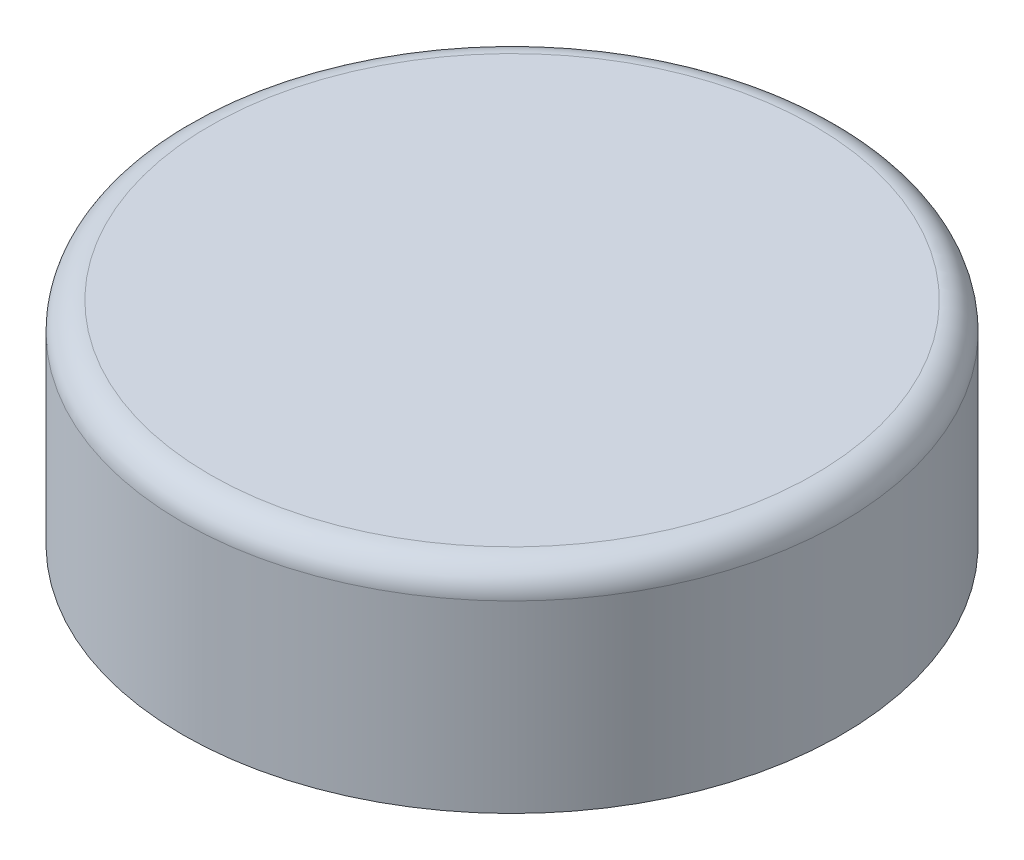
ISO-10303-21;
HEADER;
FILE_DESCRIPTION(('STEP AP214'),'2;1');
FILE_NAME('part.step','',(''),(''),'','','');
FILE_SCHEMA(('AUTOMOTIVE_DESIGN { 1 0 10303 214 1 1 1 1 }'));
ENDSEC;
DATA;
#1=APPLICATION_CONTEXT('core data for automotive mechanical design processes');
#2=APPLICATION_PROTOCOL_DEFINITION('international standard','automotive_design',2000,#1);
#3=PRODUCT_CONTEXT('',#1,'mechanical');
#4=PRODUCT('Part','Part','',(#3));
#5=PRODUCT_RELATED_PRODUCT_CATEGORY('part','',(#4));
#6=PRODUCT_DEFINITION_FORMATION('','',#4);
#7=PRODUCT_DEFINITION_CONTEXT('part definition',#1,'design');
#8=PRODUCT_DEFINITION('design','',#6,#7);
#9=PRODUCT_DEFINITION_SHAPE('','',#8);
#10=(LENGTH_UNIT() NAMED_UNIT(*) SI_UNIT(.MILLI.,.METRE.));
#11=(NAMED_UNIT(*) PLANE_ANGLE_UNIT() SI_UNIT($,.RADIAN.));
#12=(NAMED_UNIT(*) SI_UNIT($,.STERADIAN.) SOLID_ANGLE_UNIT());
#13=UNCERTAINTY_MEASURE_WITH_UNIT(LENGTH_MEASURE(1.E-05),#10,'distance_accuracy_value','');
#14=(GEOMETRIC_REPRESENTATION_CONTEXT(3) GLOBAL_UNCERTAINTY_ASSIGNED_CONTEXT((#13)) GLOBAL_UNIT_ASSIGNED_CONTEXT((#10,
#11,#12)) REPRESENTATION_CONTEXT('',''));
#15=CARTESIAN_POINT('',(0.,0.,0.));
#16=DIRECTION('',(0.,0.,1.));
#17=DIRECTION('',(1.,0.,0.));
#18=AXIS2_PLACEMENT_3D('',#15,#16,#17);
#19=CARTESIAN_POINT('',(0.,19.558,0.));
#20=DIRECTION('',(0.,-1.,0.));
#21=DIRECTION('',(0.,0.,-1.));
#22=AXIS2_PLACEMENT_3D('',#19,#20,#21);
#23=CYLINDRICAL_SURFACE('',#22,30.48);
#24=CARTESIAN_POINT('',(0.,17.018,0.));
#25=DIRECTION('',(0.,1.,0.));
#26=DIRECTION('',(0.,0.,1.));
#27=AXIS2_PLACEMENT_3D('',#24,#25,#26);
#28=CIRCLE('',#27,30.48);
#29=CARTESIAN_POINT('',(0.,17.018,30.48));
#30=VERTEX_POINT('',#29);
#31=EDGE_CURVE('E10',#30,#30,#28,.F.);
#32=ORIENTED_EDGE('',*,*,#31,.T.);
#33=EDGE_LOOP('',(#32));
#34=FACE_BOUND('',#33,.T.);
#35=CARTESIAN_POINT('',(0.,0.,0.));
#36=DIRECTION('',(0.,1.,0.));
#37=DIRECTION('',(0.,0.,1.));
#38=AXIS2_PLACEMENT_3D('',#35,#36,#37);
#39=CIRCLE('',#38,30.48);
#40=CARTESIAN_POINT('',(0.,0.,30.48));
#41=VERTEX_POINT('',#40);
#42=EDGE_CURVE('E42',#41,#41,#39,.T.);
#43=ORIENTED_EDGE('',*,*,#42,.T.);
#44=EDGE_LOOP('',(#43));
#45=FACE_BOUND('',#44,.T.);
#46=ADVANCED_FACE('F31',(#34,#45),#23,.T.);
#47=CARTESIAN_POINT('',(0.,19.558,0.));
#48=DIRECTION('',(0.,1.,0.));
#49=DIRECTION('',(0.,0.,1.));
#50=AXIS2_PLACEMENT_3D('',#47,#48,#49);
#51=PLANE('',#50);
#52=CARTESIAN_POINT('',(0.,19.558,0.));
#53=DIRECTION('',(0.,1.,0.));
#54=DIRECTION('',(0.,0.,1.));
#55=AXIS2_PLACEMENT_3D('',#52,#53,#54);
#56=CIRCLE('',#55,27.94);
#57=CARTESIAN_POINT('',(0.,19.558,27.94));
#58=VERTEX_POINT('',#57);
#59=EDGE_CURVE('E38',#58,#58,#56,.T.);
#60=ORIENTED_EDGE('',*,*,#59,.T.);
#61=EDGE_LOOP('',(#60));
#62=FACE_BOUND('',#61,.T.);
#63=ADVANCED_FACE('F52',(#62),#51,.T.);
#64=CARTESIAN_POINT('',(0.,0.,0.));
#65=DIRECTION('',(0.,1.,0.));
#66=DIRECTION('',(0.,0.,1.));
#67=AXIS2_PLACEMENT_3D('',#64,#65,#66);
#68=PLANE('',#67);
#69=ORIENTED_EDGE('',*,*,#42,.F.);
#70=EDGE_LOOP('',(#69));
#71=FACE_BOUND('',#70,.T.);
#72=ADVANCED_FACE('F50',(#71),#68,.F.);
#73=CARTESIAN_POINT('',(0.,17.018,0.));
#74=DIRECTION('',(0.,1.,0.));
#75=DIRECTION('',(0.,0.,1.));
#76=AXIS2_PLACEMENT_3D('',#73,#74,#75);
#77=TOROIDAL_SURFACE('',#76,27.94,2.54);
#78=ORIENTED_EDGE('',*,*,#31,.F.);
#79=EDGE_LOOP('',(#78));
#80=FACE_BOUND('',#79,.T.);
#81=ORIENTED_EDGE('',*,*,#59,.F.);
#82=EDGE_LOOP('',(#81));
#83=FACE_BOUND('',#82,.T.);
#84=ADVANCED_FACE('F33',(#80,#83),#77,.T.);
#85=CLOSED_SHELL('',(#46,#63,#72,#84));
#86=MANIFOLD_SOLID_BREP('B2',#85);
#87=ADVANCED_BREP_SHAPE_REPRESENTATION('',(#18,#86),#14);
#88=SHAPE_DEFINITION_REPRESENTATION(#9,#87);
ENDSEC;
END-ISO-10303-21;
